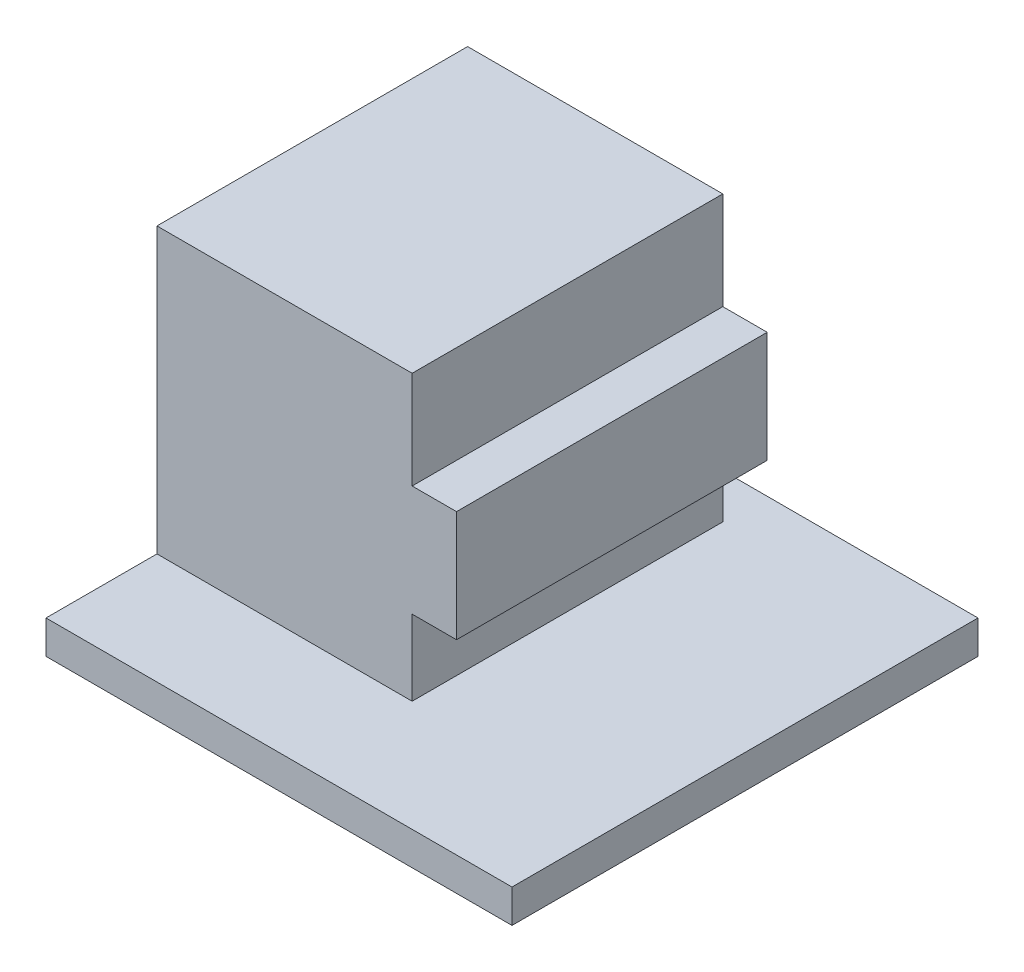
ISO-10303-21;
HEADER;
FILE_DESCRIPTION(('STEP AP214'),'2;1');
FILE_NAME('part.step','',(''),(''),'','','');
FILE_SCHEMA(('AUTOMOTIVE_DESIGN { 1 0 10303 214 1 1 1 1 }'));
ENDSEC;
DATA;
#1=APPLICATION_CONTEXT('core data for automotive mechanical design processes');
#2=APPLICATION_PROTOCOL_DEFINITION('international standard','automotive_design',2000,#1);
#3=PRODUCT_CONTEXT('',#1,'mechanical');
#4=PRODUCT('Part','Part','',(#3));
#5=PRODUCT_RELATED_PRODUCT_CATEGORY('part','',(#4));
#6=PRODUCT_DEFINITION_FORMATION('','',#4);
#7=PRODUCT_DEFINITION_CONTEXT('part definition',#1,'design');
#8=PRODUCT_DEFINITION('design','',#6,#7);
#9=PRODUCT_DEFINITION_SHAPE('','',#8);
#10=(LENGTH_UNIT() NAMED_UNIT(*) SI_UNIT(.MILLI.,.METRE.));
#11=(NAMED_UNIT(*) PLANE_ANGLE_UNIT() SI_UNIT($,.RADIAN.));
#12=(NAMED_UNIT(*) SI_UNIT($,.STERADIAN.) SOLID_ANGLE_UNIT());
#13=UNCERTAINTY_MEASURE_WITH_UNIT(LENGTH_MEASURE(1.E-05),#10,'distance_accuracy_value','');
#14=(GEOMETRIC_REPRESENTATION_CONTEXT(3) GLOBAL_UNCERTAINTY_ASSIGNED_CONTEXT((#13)) GLOBAL_UNIT_ASSIGNED_CONTEXT((#10,
#11,#12)) REPRESENTATION_CONTEXT('',''));
#15=CARTESIAN_POINT('',(0.,0.,0.));
#16=DIRECTION('',(0.,0.,1.));
#17=DIRECTION('',(1.,0.,0.));
#18=AXIS2_PLACEMENT_3D('',#15,#16,#17);
#19=CARTESIAN_POINT('',(0.,1.5,0.));
#20=DIRECTION('',(0.,-1.,0.));
#21=DIRECTION('',(0.,0.,-1.));
#22=AXIS2_PLACEMENT_3D('',#19,#20,#21);
#23=PLANE('',#22);
#24=DIRECTION('',(-1.,0.,0.));
#25=VECTOR('',#24,1.);
#26=CARTESIAN_POINT('',(11.5,1.5,-19.));
#27=LINE('',#26,#25);
#28=CARTESIAN_POINT('',(11.5,1.5,-19.));
#29=VERTEX_POINT('',#28);
#30=CARTESIAN_POINT('',(0.,1.5,-19.));
#31=VERTEX_POINT('',#30);
#32=EDGE_CURVE('E173',#29,#31,#27,.T.);
#33=ORIENTED_EDGE('',*,*,#32,.F.);
#34=DIRECTION('',(0.,0.,-1.));
#35=VECTOR('',#34,1.);
#36=CARTESIAN_POINT('',(11.5,1.5,-5.));
#37=LINE('',#36,#35);
#38=CARTESIAN_POINT('',(11.5,1.5,-5.));
#39=VERTEX_POINT('',#38);
#40=EDGE_CURVE('E193',#39,#29,#37,.T.);
#41=ORIENTED_EDGE('',*,*,#40,.F.);
#42=DIRECTION('',(-1.,0.,0.));
#43=VECTOR('',#42,1.);
#44=CARTESIAN_POINT('',(11.5,1.5,-5.));
#45=LINE('',#44,#43);
#46=CARTESIAN_POINT('',(0.,1.5,-5.));
#47=VERTEX_POINT('',#46);
#48=EDGE_CURVE('E156',#39,#47,#45,.T.);
#49=ORIENTED_EDGE('',*,*,#48,.T.);
#50=DIRECTION('',(0.,0.,1.));
#51=VECTOR('',#50,1.);
#52=CARTESIAN_POINT('',(0.,1.5,0.));
#53=LINE('',#52,#51);
#54=CARTESIAN_POINT('',(0.,1.5,0.));
#55=VERTEX_POINT('',#54);
#56=EDGE_CURVE('E90',#47,#55,#53,.T.);
#57=ORIENTED_EDGE('',*,*,#56,.T.);
#58=DIRECTION('',(1.,0.,0.));
#59=VECTOR('',#58,1.);
#60=CARTESIAN_POINT('',(0.,1.5,0.));
#61=LINE('',#60,#59);
#62=CARTESIAN_POINT('',(21.,1.5,0.));
#63=VERTEX_POINT('',#62);
#64=EDGE_CURVE('E207',#55,#63,#61,.T.);
#65=ORIENTED_EDGE('',*,*,#64,.T.);
#66=DIRECTION('',(0.,0.,-1.));
#67=VECTOR('',#66,1.);
#68=CARTESIAN_POINT('',(21.,1.5,0.));
#69=LINE('',#68,#67);
#70=CARTESIAN_POINT('',(21.,1.5,-21.));
#71=VERTEX_POINT('',#70);
#72=EDGE_CURVE('E209',#63,#71,#69,.T.);
#73=ORIENTED_EDGE('',*,*,#72,.T.);
#74=DIRECTION('',(-1.,0.,0.));
#75=VECTOR('',#74,1.);
#76=CARTESIAN_POINT('',(0.,1.5,-21.));
#77=LINE('',#76,#75);
#78=CARTESIAN_POINT('',(0.,1.5,-21.));
#79=VERTEX_POINT('',#78);
#80=EDGE_CURVE('E63',#71,#79,#77,.T.);
#81=ORIENTED_EDGE('',*,*,#80,.T.);
#82=EDGE_CURVE('E205',#79,#31,#53,.T.);
#83=ORIENTED_EDGE('',*,*,#82,.T.);
#84=EDGE_LOOP('',(#33,#41,#49,#57,#65,#73,#81,#83));
#85=FACE_BOUND('',#84,.T.);
#86=ADVANCED_FACE('F39',(#85),#23,.F.);
#87=CARTESIAN_POINT('',(0.,1.5,0.));
#88=DIRECTION('',(1.,0.,0.));
#89=DIRECTION('',(0.,0.,-1.));
#90=AXIS2_PLACEMENT_3D('',#87,#88,#89);
#91=PLANE('',#90);
#92=DIRECTION('',(0.,0.,1.));
#93=VECTOR('',#92,1.);
#94=CARTESIAN_POINT('',(0.,0.,0.));
#95=LINE('',#94,#93);
#96=CARTESIAN_POINT('',(0.,0.,-21.));
#97=VERTEX_POINT('',#96);
#98=CARTESIAN_POINT('',(0.,0.,0.));
#99=VERTEX_POINT('',#98);
#100=EDGE_CURVE('E195',#97,#99,#95,.T.);
#101=ORIENTED_EDGE('',*,*,#100,.T.);
#102=DIRECTION('',(0.,-1.,0.));
#103=VECTOR('',#102,1.);
#104=CARTESIAN_POINT('',(0.,1.5,0.));
#105=LINE('',#104,#103);
#106=EDGE_CURVE('E11',#55,#99,#105,.T.);
#107=ORIENTED_EDGE('',*,*,#106,.F.);
#108=ORIENTED_EDGE('',*,*,#56,.F.);
#109=DIRECTION('',(0.,1.,0.));
#110=VECTOR('',#109,1.);
#111=CARTESIAN_POINT('',(0.,1.5,-5.));
#112=LINE('',#111,#110);
#113=CARTESIAN_POINT('',(0.,14.3,-5.));
#114=VERTEX_POINT('',#113);
#115=EDGE_CURVE('E54',#47,#114,#112,.T.);
#116=ORIENTED_EDGE('',*,*,#115,.T.);
#117=DIRECTION('',(0.,0.,-1.));
#118=VECTOR('',#117,1.);
#119=CARTESIAN_POINT('',(0.,14.3,-5.));
#120=LINE('',#119,#118);
#121=CARTESIAN_POINT('',(0.,14.3,-19.));
#122=VERTEX_POINT('',#121);
#123=EDGE_CURVE('E138',#114,#122,#120,.T.);
#124=ORIENTED_EDGE('',*,*,#123,.T.);
#125=DIRECTION('',(0.,1.,0.));
#126=VECTOR('',#125,1.);
#127=CARTESIAN_POINT('',(0.,1.5,-19.));
#128=LINE('',#127,#126);
#129=EDGE_CURVE('E176',#31,#122,#128,.T.);
#130=ORIENTED_EDGE('',*,*,#129,.F.);
#131=ORIENTED_EDGE('',*,*,#82,.F.);
#132=DIRECTION('',(0.,-1.,0.));
#133=VECTOR('',#132,1.);
#134=CARTESIAN_POINT('',(0.,1.5,-21.));
#135=LINE('',#134,#133);
#136=EDGE_CURVE('E212',#79,#97,#135,.T.);
#137=ORIENTED_EDGE('',*,*,#136,.T.);
#138=EDGE_LOOP('',(#101,#107,#108,#116,#124,#130,#131,#137));
#139=FACE_BOUND('',#138,.T.);
#140=ADVANCED_FACE('F41',(#139),#91,.F.);
#141=CARTESIAN_POINT('',(0.,1.5,0.));
#142=DIRECTION('',(0.,0.,-1.));
#143=DIRECTION('',(-1.,0.,0.));
#144=AXIS2_PLACEMENT_3D('',#141,#142,#143);
#145=PLANE('',#144);
#146=DIRECTION('',(1.,0.,0.));
#147=VECTOR('',#146,1.);
#148=CARTESIAN_POINT('',(0.,0.,0.));
#149=LINE('',#148,#147);
#150=CARTESIAN_POINT('',(21.,0.,0.));
#151=VERTEX_POINT('',#150);
#152=EDGE_CURVE('E214',#99,#151,#149,.T.);
#153=ORIENTED_EDGE('',*,*,#152,.T.);
#154=DIRECTION('',(0.,-1.,0.));
#155=VECTOR('',#154,1.);
#156=CARTESIAN_POINT('',(21.,1.5,0.));
#157=LINE('',#156,#155);
#158=EDGE_CURVE('E47',#63,#151,#157,.T.);
#159=ORIENTED_EDGE('',*,*,#158,.F.);
#160=ORIENTED_EDGE('',*,*,#64,.F.);
#161=ORIENTED_EDGE('',*,*,#106,.T.);
#162=EDGE_LOOP('',(#153,#159,#160,#161));
#163=FACE_BOUND('',#162,.T.);
#164=ADVANCED_FACE('F242',(#163),#145,.F.);
#165=CARTESIAN_POINT('',(21.,1.5,0.));
#166=DIRECTION('',(-1.,0.,0.));
#167=DIRECTION('',(0.,0.,1.));
#168=AXIS2_PLACEMENT_3D('',#165,#166,#167);
#169=PLANE('',#168);
#170=DIRECTION('',(0.,0.,-1.));
#171=VECTOR('',#170,1.);
#172=CARTESIAN_POINT('',(21.,0.,0.));
#173=LINE('',#172,#171);
#174=CARTESIAN_POINT('',(21.,0.,-21.));
#175=VERTEX_POINT('',#174);
#176=EDGE_CURVE('E216',#151,#175,#173,.T.);
#177=ORIENTED_EDGE('',*,*,#176,.T.);
#178=DIRECTION('',(0.,-1.,0.));
#179=VECTOR('',#178,1.);
#180=CARTESIAN_POINT('',(21.,1.5,-21.));
#181=LINE('',#180,#179);
#182=EDGE_CURVE('E220',#71,#175,#181,.T.);
#183=ORIENTED_EDGE('',*,*,#182,.F.);
#184=ORIENTED_EDGE('',*,*,#72,.F.);
#185=ORIENTED_EDGE('',*,*,#158,.T.);
#186=EDGE_LOOP('',(#177,#183,#184,#185));
#187=FACE_BOUND('',#186,.T.);
#188=ADVANCED_FACE('F226',(#187),#169,.F.);
#189=CARTESIAN_POINT('',(0.,1.5,-21.));
#190=DIRECTION('',(0.,0.,1.));
#191=DIRECTION('',(1.,0.,0.));
#192=AXIS2_PLACEMENT_3D('',#189,#190,#191);
#193=PLANE('',#192);
#194=DIRECTION('',(-1.,0.,0.));
#195=VECTOR('',#194,1.);
#196=CARTESIAN_POINT('',(0.,0.,-21.));
#197=LINE('',#196,#195);
#198=EDGE_CURVE('E84',#175,#97,#197,.T.);
#199=ORIENTED_EDGE('',*,*,#198,.T.);
#200=ORIENTED_EDGE('',*,*,#136,.F.);
#201=ORIENTED_EDGE('',*,*,#80,.F.);
#202=ORIENTED_EDGE('',*,*,#182,.T.);
#203=EDGE_LOOP('',(#199,#200,#201,#202));
#204=FACE_BOUND('',#203,.T.);
#205=ADVANCED_FACE('F233',(#204),#193,.F.);
#206=CARTESIAN_POINT('',(0.,0.,0.));
#207=DIRECTION('',(0.,-1.,0.));
#208=DIRECTION('',(0.,0.,-1.));
#209=AXIS2_PLACEMENT_3D('',#206,#207,#208);
#210=PLANE('',#209);
#211=ORIENTED_EDGE('',*,*,#100,.F.);
#212=ORIENTED_EDGE('',*,*,#198,.F.);
#213=ORIENTED_EDGE('',*,*,#176,.F.);
#214=ORIENTED_EDGE('',*,*,#152,.F.);
#215=EDGE_LOOP('',(#211,#212,#213,#214));
#216=FACE_BOUND('',#215,.T.);
#217=ADVANCED_FACE('F231',(#216),#210,.T.);
#218=CARTESIAN_POINT('',(11.5,4.9,-5.));
#219=DIRECTION('',(1.,0.,0.));
#220=DIRECTION('',(0.,0.,-1.));
#221=AXIS2_PLACEMENT_3D('',#218,#219,#220);
#222=PLANE('',#221);
#223=DIRECTION('',(0.,-1.,0.));
#224=VECTOR('',#223,1.);
#225=CARTESIAN_POINT('',(11.5,4.9,-19.));
#226=LINE('',#225,#224);
#227=CARTESIAN_POINT('',(11.5,4.9,-19.));
#228=VERTEX_POINT('',#227);
#229=EDGE_CURVE('E158',#228,#29,#226,.T.);
#230=ORIENTED_EDGE('',*,*,#229,.F.);
#231=DIRECTION('',(0.,0.,-1.));
#232=VECTOR('',#231,1.);
#233=CARTESIAN_POINT('',(11.5,4.9,-5.));
#234=LINE('',#233,#232);
#235=CARTESIAN_POINT('',(11.5,4.9,-5.));
#236=VERTEX_POINT('',#235);
#237=EDGE_CURVE('E196',#236,#228,#234,.T.);
#238=ORIENTED_EDGE('',*,*,#237,.F.);
#239=DIRECTION('',(0.,-1.,0.));
#240=VECTOR('',#239,1.);
#241=CARTESIAN_POINT('',(11.5,4.9,-5.));
#242=LINE('',#241,#240);
#243=EDGE_CURVE('E146',#236,#39,#242,.T.);
#244=ORIENTED_EDGE('',*,*,#243,.T.);
#245=ORIENTED_EDGE('',*,*,#40,.T.);
#246=EDGE_LOOP('',(#230,#238,#244,#245));
#247=FACE_BOUND('',#246,.T.);
#248=ADVANCED_FACE('F240',(#247),#222,.T.);
#249=CARTESIAN_POINT('',(13.5,4.9,-5.));
#250=DIRECTION('',(0.,-1.,0.));
#251=DIRECTION('',(0.,0.,-1.));
#252=AXIS2_PLACEMENT_3D('',#249,#250,#251);
#253=PLANE('',#252);
#254=DIRECTION('',(-1.,0.,0.));
#255=VECTOR('',#254,1.);
#256=CARTESIAN_POINT('',(13.5,4.9,-19.));
#257=LINE('',#256,#255);
#258=CARTESIAN_POINT('',(13.5,4.9,-19.));
#259=VERTEX_POINT('',#258);
#260=EDGE_CURVE('E188',#259,#228,#257,.T.);
#261=ORIENTED_EDGE('',*,*,#260,.F.);
#262=DIRECTION('',(0.,0.,-1.));
#263=VECTOR('',#262,1.);
#264=CARTESIAN_POINT('',(13.5,4.9,-5.));
#265=LINE('',#264,#263);
#266=CARTESIAN_POINT('',(13.5,4.9,-5.));
#267=VERTEX_POINT('',#266);
#268=EDGE_CURVE('E198',#267,#259,#265,.T.);
#269=ORIENTED_EDGE('',*,*,#268,.F.);
#270=DIRECTION('',(-1.,0.,0.));
#271=VECTOR('',#270,1.);
#272=CARTESIAN_POINT('',(13.5,4.9,-5.));
#273=LINE('',#272,#271);
#274=EDGE_CURVE('E168',#267,#236,#273,.T.);
#275=ORIENTED_EDGE('',*,*,#274,.T.);
#276=ORIENTED_EDGE('',*,*,#237,.T.);
#277=EDGE_LOOP('',(#261,#269,#275,#276));
#278=FACE_BOUND('',#277,.T.);
#279=ADVANCED_FACE('F264',(#278),#253,.T.);
#280=CARTESIAN_POINT('',(13.5,9.9,-5.));
#281=DIRECTION('',(1.,0.,0.));
#282=DIRECTION('',(0.,0.,-1.));
#283=AXIS2_PLACEMENT_3D('',#280,#281,#282);
#284=PLANE('',#283);
#285=DIRECTION('',(0.,-1.,0.));
#286=VECTOR('',#285,1.);
#287=CARTESIAN_POINT('',(13.5,9.9,-19.));
#288=LINE('',#287,#286);
#289=CARTESIAN_POINT('',(13.5,9.9,-19.));
#290=VERTEX_POINT('',#289);
#291=EDGE_CURVE('E185',#290,#259,#288,.T.);
#292=ORIENTED_EDGE('',*,*,#291,.F.);
#293=DIRECTION('',(0.,0.,-1.));
#294=VECTOR('',#293,1.);
#295=CARTESIAN_POINT('',(13.5,9.9,-5.));
#296=LINE('',#295,#294);
#297=CARTESIAN_POINT('',(13.5,9.9,-5.));
#298=VERTEX_POINT('',#297);
#299=EDGE_CURVE('E200',#298,#290,#296,.T.);
#300=ORIENTED_EDGE('',*,*,#299,.F.);
#301=DIRECTION('',(0.,-1.,0.));
#302=VECTOR('',#301,1.);
#303=CARTESIAN_POINT('',(13.5,9.9,-5.));
#304=LINE('',#303,#302);
#305=EDGE_CURVE('E165',#298,#267,#304,.T.);
#306=ORIENTED_EDGE('',*,*,#305,.T.);
#307=ORIENTED_EDGE('',*,*,#268,.T.);
#308=EDGE_LOOP('',(#292,#300,#306,#307));
#309=FACE_BOUND('',#308,.T.);
#310=ADVANCED_FACE('F260',(#309),#284,.T.);
#311=CARTESIAN_POINT('',(11.5,9.9,-5.));
#312=DIRECTION('',(0.,1.,0.));
#313=DIRECTION('',(0.,0.,1.));
#314=AXIS2_PLACEMENT_3D('',#311,#312,#313);
#315=PLANE('',#314);
#316=DIRECTION('',(1.,0.,0.));
#317=VECTOR('',#316,1.);
#318=CARTESIAN_POINT('',(11.5,9.9,-19.));
#319=LINE('',#318,#317);
#320=CARTESIAN_POINT('',(11.5,9.9,-19.));
#321=VERTEX_POINT('',#320);
#322=EDGE_CURVE('E182',#321,#290,#319,.T.);
#323=ORIENTED_EDGE('',*,*,#322,.F.);
#324=DIRECTION('',(0.,0.,-1.));
#325=VECTOR('',#324,1.);
#326=CARTESIAN_POINT('',(11.5,9.9,-5.));
#327=LINE('',#326,#325);
#328=CARTESIAN_POINT('',(11.5,9.9,-5.));
#329=VERTEX_POINT('',#328);
#330=EDGE_CURVE('E202',#329,#321,#327,.T.);
#331=ORIENTED_EDGE('',*,*,#330,.F.);
#332=DIRECTION('',(1.,0.,0.));
#333=VECTOR('',#332,1.);
#334=CARTESIAN_POINT('',(11.5,9.9,-5.));
#335=LINE('',#334,#333);
#336=EDGE_CURVE('E162',#329,#298,#335,.T.);
#337=ORIENTED_EDGE('',*,*,#336,.T.);
#338=ORIENTED_EDGE('',*,*,#299,.T.);
#339=EDGE_LOOP('',(#323,#331,#337,#338));
#340=FACE_BOUND('',#339,.T.);
#341=ADVANCED_FACE('F256',(#340),#315,.T.);
#342=CARTESIAN_POINT('',(11.5,14.3,-5.));
#343=DIRECTION('',(1.,0.,0.));
#344=DIRECTION('',(0.,1.,0.));
#345=AXIS2_PLACEMENT_3D('',#342,#343,#344);
#346=PLANE('',#345);
#347=DIRECTION('',(0.,-1.,0.));
#348=VECTOR('',#347,1.);
#349=CARTESIAN_POINT('',(11.5,14.3,-19.));
#350=LINE('',#349,#348);
#351=CARTESIAN_POINT('',(11.5,14.3,-19.));
#352=VERTEX_POINT('',#351);
#353=EDGE_CURVE('E179',#352,#321,#350,.T.);
#354=ORIENTED_EDGE('',*,*,#353,.F.);
#355=DIRECTION('',(0.,0.,-1.));
#356=VECTOR('',#355,1.);
#357=CARTESIAN_POINT('',(11.5,14.3,-5.));
#358=LINE('',#357,#356);
#359=CARTESIAN_POINT('',(11.5,14.3,-5.));
#360=VERTEX_POINT('',#359);
#361=EDGE_CURVE('E145',#360,#352,#358,.T.);
#362=ORIENTED_EDGE('',*,*,#361,.F.);
#363=DIRECTION('',(0.,-1.,0.));
#364=VECTOR('',#363,1.);
#365=CARTESIAN_POINT('',(11.5,14.3,-5.));
#366=LINE('',#365,#364);
#367=EDGE_CURVE('E152',#360,#329,#366,.T.);
#368=ORIENTED_EDGE('',*,*,#367,.T.);
#369=ORIENTED_EDGE('',*,*,#330,.T.);
#370=EDGE_LOOP('',(#354,#362,#368,#369));
#371=FACE_BOUND('',#370,.T.);
#372=ADVANCED_FACE('F253',(#371),#346,.T.);
#373=CARTESIAN_POINT('',(0.,14.3,-5.));
#374=DIRECTION('',(0.,1.,0.));
#375=DIRECTION('',(-1.,0.,0.));
#376=AXIS2_PLACEMENT_3D('',#373,#374,#375);
#377=PLANE('',#376);
#378=DIRECTION('',(1.,0.,0.));
#379=VECTOR('',#378,1.);
#380=CARTESIAN_POINT('',(0.,14.3,-19.));
#381=LINE('',#380,#379);
#382=EDGE_CURVE('E142',#122,#352,#381,.T.);
#383=ORIENTED_EDGE('',*,*,#382,.F.);
#384=ORIENTED_EDGE('',*,*,#123,.F.);
#385=DIRECTION('',(1.,0.,0.));
#386=VECTOR('',#385,1.);
#387=CARTESIAN_POINT('',(0.,14.3,-5.));
#388=LINE('',#387,#386);
#389=EDGE_CURVE('E140',#114,#360,#388,.T.);
#390=ORIENTED_EDGE('',*,*,#389,.T.);
#391=ORIENTED_EDGE('',*,*,#361,.T.);
#392=EDGE_LOOP('',(#383,#384,#390,#391));
#393=FACE_BOUND('',#392,.T.);
#394=ADVANCED_FACE('F139',(#393),#377,.T.);
#395=CARTESIAN_POINT('',(0.,0.,-5.));
#396=DIRECTION('',(0.,0.,-1.));
#397=DIRECTION('',(-1.,0.,0.));
#398=AXIS2_PLACEMENT_3D('',#395,#396,#397);
#399=PLANE('',#398);
#400=ORIENTED_EDGE('',*,*,#48,.F.);
#401=ORIENTED_EDGE('',*,*,#243,.F.);
#402=ORIENTED_EDGE('',*,*,#274,.F.);
#403=ORIENTED_EDGE('',*,*,#305,.F.);
#404=ORIENTED_EDGE('',*,*,#336,.F.);
#405=ORIENTED_EDGE('',*,*,#367,.F.);
#406=ORIENTED_EDGE('',*,*,#389,.F.);
#407=ORIENTED_EDGE('',*,*,#115,.F.);
#408=EDGE_LOOP('',(#400,#401,#402,#403,#404,#405,#406,#407));
#409=FACE_BOUND('',#408,.T.);
#410=ADVANCED_FACE('F149',(#409),#399,.F.);
#411=CARTESIAN_POINT('',(0.,0.,-19.));
#412=DIRECTION('',(0.,0.,-1.));
#413=DIRECTION('',(-1.,0.,0.));
#414=AXIS2_PLACEMENT_3D('',#411,#412,#413);
#415=PLANE('',#414);
#416=ORIENTED_EDGE('',*,*,#32,.T.);
#417=ORIENTED_EDGE('',*,*,#129,.T.);
#418=ORIENTED_EDGE('',*,*,#382,.T.);
#419=ORIENTED_EDGE('',*,*,#353,.T.);
#420=ORIENTED_EDGE('',*,*,#322,.T.);
#421=ORIENTED_EDGE('',*,*,#291,.T.);
#422=ORIENTED_EDGE('',*,*,#260,.T.);
#423=ORIENTED_EDGE('',*,*,#229,.T.);
#424=EDGE_LOOP('',(#416,#417,#418,#419,#420,#421,#422,#423));
#425=FACE_BOUND('',#424,.T.);
#426=ADVANCED_FACE('F272',(#425),#415,.T.);
#427=CLOSED_SHELL('',(#86,#140,#164,#188,#205,#217,#248,#279,#310,#341,#372,#394,#410,#426));
#428=MANIFOLD_SOLID_BREP('B2',#427);
#429=ADVANCED_BREP_SHAPE_REPRESENTATION('',(#18,#428),#14);
#430=SHAPE_DEFINITION_REPRESENTATION(#9,#429);
ENDSEC;
END-ISO-10303-21;
